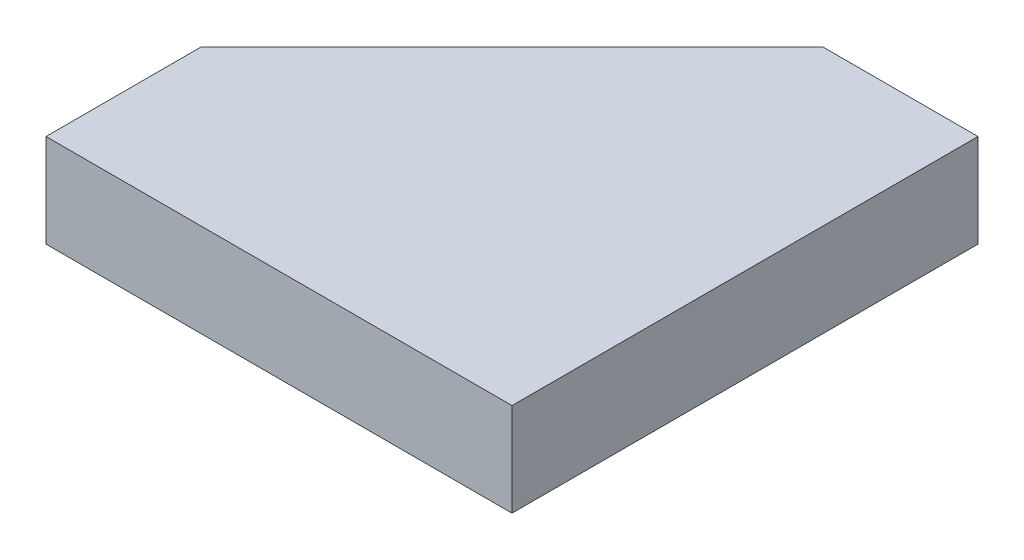
ISO-10303-21;
HEADER;
FILE_DESCRIPTION(('STEP AP214'),'2;1');
FILE_NAME('part.step','',(''),(''),'','','');
FILE_SCHEMA(('AUTOMOTIVE_DESIGN { 1 0 10303 214 1 1 1 1 }'));
ENDSEC;
DATA;
#1=APPLICATION_CONTEXT('core data for automotive mechanical design processes');
#2=APPLICATION_PROTOCOL_DEFINITION('international standard','automotive_design',2000,#1);
#3=PRODUCT_CONTEXT('',#1,'mechanical');
#4=PRODUCT('Part','Part','',(#3));
#5=PRODUCT_RELATED_PRODUCT_CATEGORY('part','',(#4));
#6=PRODUCT_DEFINITION_FORMATION('','',#4);
#7=PRODUCT_DEFINITION_CONTEXT('part definition',#1,'design');
#8=PRODUCT_DEFINITION('design','',#6,#7);
#9=PRODUCT_DEFINITION_SHAPE('','',#8);
#10=(LENGTH_UNIT() NAMED_UNIT(*) SI_UNIT(.MILLI.,.METRE.));
#11=(NAMED_UNIT(*) PLANE_ANGLE_UNIT() SI_UNIT($,.RADIAN.));
#12=(NAMED_UNIT(*) SI_UNIT($,.STERADIAN.) SOLID_ANGLE_UNIT());
#13=UNCERTAINTY_MEASURE_WITH_UNIT(LENGTH_MEASURE(1.E-05),#10,'distance_accuracy_value','');
#14=(GEOMETRIC_REPRESENTATION_CONTEXT(3) GLOBAL_UNCERTAINTY_ASSIGNED_CONTEXT((#13)) GLOBAL_UNIT_ASSIGNED_CONTEXT((#10,
#11,#12)) REPRESENTATION_CONTEXT('',''));
#15=CARTESIAN_POINT('',(0.,0.,0.));
#16=DIRECTION('',(0.,0.,1.));
#17=DIRECTION('',(1.,0.,0.));
#18=AXIS2_PLACEMENT_3D('',#15,#16,#17);
#19=CARTESIAN_POINT('',(15.,6.,-15.));
#20=DIRECTION('',(-1.,0.,0.));
#21=DIRECTION('',(0.,0.,1.));
#22=AXIS2_PLACEMENT_3D('',#19,#20,#21);
#23=PLANE('',#22);
#24=DIRECTION('',(0.,0.,-1.));
#25=VECTOR('',#24,1.);
#26=CARTESIAN_POINT('',(15.,0.,-15.));
#27=LINE('',#26,#25);
#28=CARTESIAN_POINT('',(15.,0.,15.));
#29=VERTEX_POINT('',#28);
#30=CARTESIAN_POINT('',(15.,0.,-15.));
#31=VERTEX_POINT('',#30);
#32=EDGE_CURVE('E97',#29,#31,#27,.T.);
#33=ORIENTED_EDGE('',*,*,#32,.T.);
#34=DIRECTION('',(0.,-1.,0.));
#35=VECTOR('',#34,1.);
#36=CARTESIAN_POINT('',(15.,6.,-15.));
#37=LINE('',#36,#35);
#38=CARTESIAN_POINT('',(15.,6.,-15.));
#39=VERTEX_POINT('',#38);
#40=EDGE_CURVE('E80',#39,#31,#37,.T.);
#41=ORIENTED_EDGE('',*,*,#40,.F.);
#42=DIRECTION('',(0.,0.,-1.));
#43=VECTOR('',#42,1.);
#44=CARTESIAN_POINT('',(15.,6.,-15.));
#45=LINE('',#44,#43);
#46=CARTESIAN_POINT('',(15.,6.,15.));
#47=VERTEX_POINT('',#46);
#48=EDGE_CURVE('E85',#47,#39,#45,.T.);
#49=ORIENTED_EDGE('',*,*,#48,.F.);
#50=DIRECTION('',(0.,-1.,0.));
#51=VECTOR('',#50,1.);
#52=CARTESIAN_POINT('',(15.,6.,15.));
#53=LINE('',#52,#51);
#54=EDGE_CURVE('E104',#47,#29,#53,.T.);
#55=ORIENTED_EDGE('',*,*,#54,.T.);
#56=EDGE_LOOP('',(#33,#41,#49,#55));
#57=FACE_BOUND('',#56,.T.);
#58=ADVANCED_FACE('F33',(#57),#23,.F.);
#59=CARTESIAN_POINT('',(-15.,6.,-15.));
#60=DIRECTION('',(0.,0.,1.));
#61=DIRECTION('',(1.,0.,0.));
#62=AXIS2_PLACEMENT_3D('',#59,#60,#61);
#63=PLANE('',#62);
#64=DIRECTION('',(-1.,0.,0.));
#65=VECTOR('',#64,1.);
#66=CARTESIAN_POINT('',(-15.,0.,-15.));
#67=LINE('',#66,#65);
#68=CARTESIAN_POINT('',(5.00000000000008,0.,-15.));
#69=VERTEX_POINT('',#68);
#70=EDGE_CURVE('E112',#31,#69,#67,.T.);
#71=ORIENTED_EDGE('',*,*,#70,.T.);
#72=DIRECTION('',(0.,1.,0.));
#73=VECTOR('',#72,1.);
#74=CARTESIAN_POINT('',(5.00000000000008,6.,-15.));
#75=LINE('',#74,#73);
#76=CARTESIAN_POINT('',(5.00000000000007,6.,-15.));
#77=VERTEX_POINT('',#76);
#78=EDGE_CURVE('E41',#69,#77,#75,.T.);
#79=ORIENTED_EDGE('',*,*,#78,.T.);
#80=DIRECTION('',(-1.,0.,0.));
#81=VECTOR('',#80,1.);
#82=CARTESIAN_POINT('',(-15.,6.,-15.));
#83=LINE('',#82,#81);
#84=EDGE_CURVE('E76',#39,#77,#83,.T.);
#85=ORIENTED_EDGE('',*,*,#84,.F.);
#86=ORIENTED_EDGE('',*,*,#40,.T.);
#87=EDGE_LOOP('',(#71,#79,#85,#86));
#88=FACE_BOUND('',#87,.T.);
#89=ADVANCED_FACE('F78',(#88),#63,.F.);
#90=CARTESIAN_POINT('',(-15.,6.,-15.));
#91=DIRECTION('',(1.,0.,0.));
#92=DIRECTION('',(0.,0.,-1.));
#93=AXIS2_PLACEMENT_3D('',#90,#91,#92);
#94=PLANE('',#93);
#95=DIRECTION('',(0.,0.,1.));
#96=VECTOR('',#95,1.);
#97=CARTESIAN_POINT('',(-15.,6.,-15.));
#98=LINE('',#97,#96);
#99=CARTESIAN_POINT('',(-15.,6.,5.));
#100=VERTEX_POINT('',#99);
#101=CARTESIAN_POINT('',(-15.,6.,15.));
#102=VERTEX_POINT('',#101);
#103=EDGE_CURVE('E84',#100,#102,#98,.T.);
#104=ORIENTED_EDGE('',*,*,#103,.F.);
#105=DIRECTION('',(0.,-1.,0.));
#106=VECTOR('',#105,1.);
#107=CARTESIAN_POINT('',(-15.,6.,5.));
#108=LINE('',#107,#106);
#109=CARTESIAN_POINT('',(-15.,0.,5.));
#110=VERTEX_POINT('',#109);
#111=EDGE_CURVE('E98',#100,#110,#108,.T.);
#112=ORIENTED_EDGE('',*,*,#111,.T.);
#113=DIRECTION('',(0.,0.,1.));
#114=VECTOR('',#113,1.);
#115=CARTESIAN_POINT('',(-15.,0.,-15.));
#116=LINE('',#115,#114);
#117=CARTESIAN_POINT('',(-15.,0.,15.));
#118=VERTEX_POINT('',#117);
#119=EDGE_CURVE('E110',#110,#118,#116,.T.);
#120=ORIENTED_EDGE('',*,*,#119,.T.);
#121=DIRECTION('',(0.,-1.,0.));
#122=VECTOR('',#121,1.);
#123=CARTESIAN_POINT('',(-15.,6.,15.));
#124=LINE('',#123,#122);
#125=EDGE_CURVE('E99',#102,#118,#124,.T.);
#126=ORIENTED_EDGE('',*,*,#125,.F.);
#127=EDGE_LOOP('',(#104,#112,#120,#126));
#128=FACE_BOUND('',#127,.T.);
#129=ADVANCED_FACE('F120',(#128),#94,.F.);
#130=CARTESIAN_POINT('',(-15.,6.,15.));
#131=DIRECTION('',(0.,0.,-1.));
#132=DIRECTION('',(-1.,0.,0.));
#133=AXIS2_PLACEMENT_3D('',#130,#131,#132);
#134=PLANE('',#133);
#135=DIRECTION('',(1.,0.,0.));
#136=VECTOR('',#135,1.);
#137=CARTESIAN_POINT('',(-15.,0.,15.));
#138=LINE('',#137,#136);
#139=EDGE_CURVE('E94',#118,#29,#138,.T.);
#140=ORIENTED_EDGE('',*,*,#139,.T.);
#141=ORIENTED_EDGE('',*,*,#54,.F.);
#142=DIRECTION('',(1.,0.,0.));
#143=VECTOR('',#142,1.);
#144=CARTESIAN_POINT('',(-15.,6.,15.));
#145=LINE('',#144,#143);
#146=EDGE_CURVE('E90',#102,#47,#145,.T.);
#147=ORIENTED_EDGE('',*,*,#146,.F.);
#148=ORIENTED_EDGE('',*,*,#125,.T.);
#149=EDGE_LOOP('',(#140,#141,#147,#148));
#150=FACE_BOUND('',#149,.T.);
#151=ADVANCED_FACE('F123',(#150),#134,.F.);
#152=CARTESIAN_POINT('',(0.,6.,0.));
#153=DIRECTION('',(0.,1.,0.));
#154=DIRECTION('',(0.,0.,1.));
#155=AXIS2_PLACEMENT_3D('',#152,#153,#154);
#156=PLANE('',#155);
#157=ORIENTED_EDGE('',*,*,#84,.T.);
#158=DIRECTION('',(0.707106781186549,0.,-0.707106781186546));
#159=VECTOR('',#158,1.);
#160=CARTESIAN_POINT('',(-4.99999999999997,6.,-4.99999999999999));
#161=LINE('',#160,#159);
#162=EDGE_CURVE('E11',#77,#100,#161,.F.);
#163=ORIENTED_EDGE('',*,*,#162,.T.);
#164=ORIENTED_EDGE('',*,*,#103,.T.);
#165=ORIENTED_EDGE('',*,*,#146,.T.);
#166=ORIENTED_EDGE('',*,*,#48,.T.);
#167=EDGE_LOOP('',(#157,#163,#164,#165,#166));
#168=FACE_BOUND('',#167,.T.);
#169=ADVANCED_FACE('F88',(#168),#156,.T.);
#170=CARTESIAN_POINT('',(0.,0.,0.));
#171=DIRECTION('',(0.,1.,0.));
#172=DIRECTION('',(0.,0.,1.));
#173=AXIS2_PLACEMENT_3D('',#170,#171,#172);
#174=PLANE('',#173);
#175=ORIENTED_EDGE('',*,*,#119,.F.);
#176=DIRECTION('',(-0.707106781186549,0.,0.707106781186546));
#177=VECTOR('',#176,1.);
#178=CARTESIAN_POINT('',(-15.,0.,5.));
#179=LINE('',#178,#177);
#180=EDGE_CURVE('E55',#110,#69,#179,.F.);
#181=ORIENTED_EDGE('',*,*,#180,.T.);
#182=ORIENTED_EDGE('',*,*,#70,.F.);
#183=ORIENTED_EDGE('',*,*,#32,.F.);
#184=ORIENTED_EDGE('',*,*,#139,.F.);
#185=EDGE_LOOP('',(#175,#181,#182,#183,#184));
#186=FACE_BOUND('',#185,.T.);
#187=ADVANCED_FACE('F124',(#186),#174,.F.);
#188=CARTESIAN_POINT('',(-15.,6.,5.));
#189=DIRECTION('',(0.707106781186546,0.,0.707106781186549));
#190=DIRECTION('',(0.,-1.,0.));
#191=AXIS2_PLACEMENT_3D('',#188,#189,#190);
#192=PLANE('',#191);
#193=ORIENTED_EDGE('',*,*,#162,.F.);
#194=ORIENTED_EDGE('',*,*,#78,.F.);
#195=ORIENTED_EDGE('',*,*,#180,.F.);
#196=ORIENTED_EDGE('',*,*,#111,.F.);
#197=EDGE_LOOP('',(#193,#194,#195,#196));
#198=FACE_BOUND('',#197,.T.);
#199=ADVANCED_FACE('F35',(#198),#192,.F.);
#200=CLOSED_SHELL('',(#58,#89,#129,#151,#169,#187,#199));
#201=MANIFOLD_SOLID_BREP('B2',#200);
#202=ADVANCED_BREP_SHAPE_REPRESENTATION('',(#18,#201),#14);
#203=SHAPE_DEFINITION_REPRESENTATION(#9,#202);
ENDSEC;
END-ISO-10303-21;
